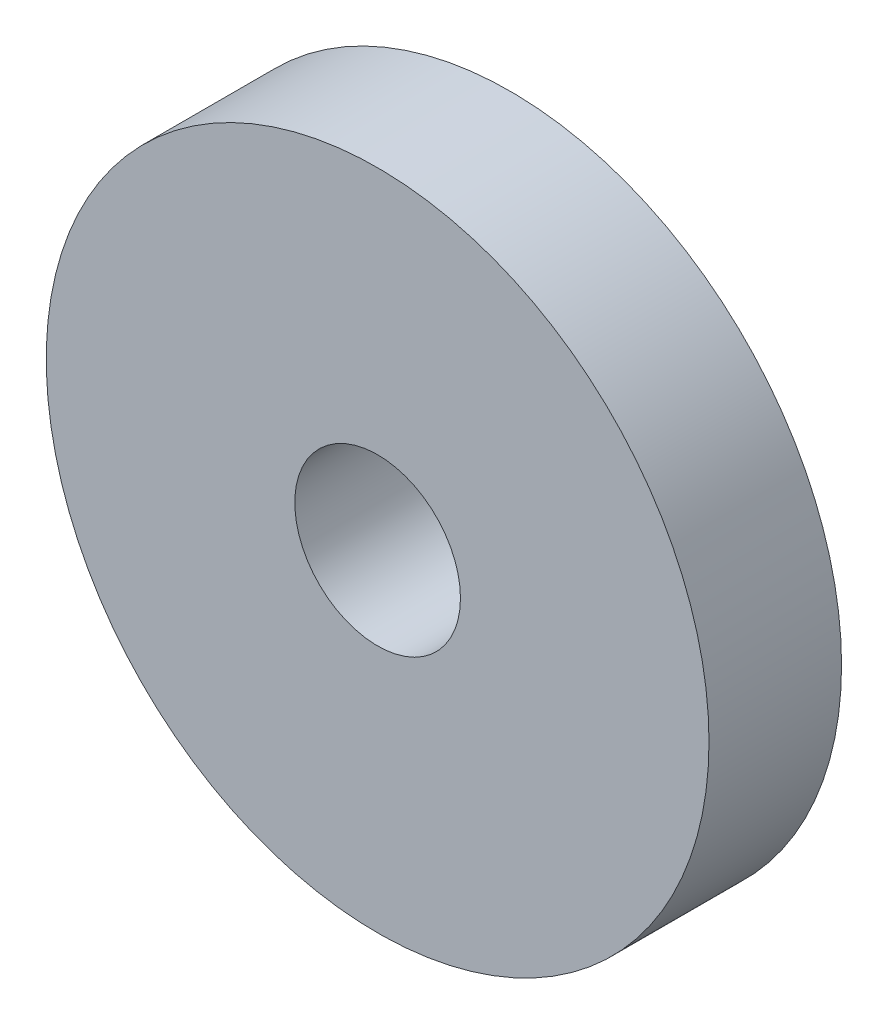
ISO-10303-21;
HEADER;
FILE_DESCRIPTION(('STEP AP214'),'2;1');
FILE_NAME('part.step','',(''),(''),'','','');
FILE_SCHEMA(('AUTOMOTIVE_DESIGN { 1 0 10303 214 1 1 1 1 }'));
ENDSEC;
DATA;
#1=APPLICATION_CONTEXT('core data for automotive mechanical design processes');
#2=APPLICATION_PROTOCOL_DEFINITION('international standard','automotive_design',2000,#1);
#3=PRODUCT_CONTEXT('',#1,'mechanical');
#4=PRODUCT('Part','Part','',(#3));
#5=PRODUCT_RELATED_PRODUCT_CATEGORY('part','',(#4));
#6=PRODUCT_DEFINITION_FORMATION('','',#4);
#7=PRODUCT_DEFINITION_CONTEXT('part definition',#1,'design');
#8=PRODUCT_DEFINITION('design','',#6,#7);
#9=PRODUCT_DEFINITION_SHAPE('','',#8);
#10=(LENGTH_UNIT() NAMED_UNIT(*) SI_UNIT(.MILLI.,.METRE.));
#11=(NAMED_UNIT(*) PLANE_ANGLE_UNIT() SI_UNIT($,.RADIAN.));
#12=(NAMED_UNIT(*) SI_UNIT($,.STERADIAN.) SOLID_ANGLE_UNIT());
#13=UNCERTAINTY_MEASURE_WITH_UNIT(LENGTH_MEASURE(1.E-05),#10,'distance_accuracy_value','');
#14=(GEOMETRIC_REPRESENTATION_CONTEXT(3) GLOBAL_UNCERTAINTY_ASSIGNED_CONTEXT((#13)) GLOBAL_UNIT_ASSIGNED_CONTEXT((#10,
#11,#12)) REPRESENTATION_CONTEXT('',''));
#15=CARTESIAN_POINT('',(0.,0.,0.));
#16=DIRECTION('',(0.,0.,1.));
#17=DIRECTION('',(1.,0.,0.));
#18=AXIS2_PLACEMENT_3D('',#15,#16,#17);
#19=CARTESIAN_POINT('',(0.,0.,2.));
#20=DIRECTION('',(0.,0.,1.));
#21=DIRECTION('',(1.,0.,0.));
#22=AXIS2_PLACEMENT_3D('',#19,#20,#21);
#23=PLANE('',#22);
#24=CARTESIAN_POINT('',(0.,0.,2.));
#25=DIRECTION('',(0.,0.,1.));
#26=DIRECTION('',(1.,0.,0.));
#27=AXIS2_PLACEMENT_3D('',#24,#25,#26);
#28=CIRCLE('',#27,4.99999999999989);
#29=CARTESIAN_POINT('',(4.99999999999989,0.,2.));
#30=VERTEX_POINT('',#29);
#31=EDGE_CURVE('E10',#30,#30,#28,.T.);
#32=ORIENTED_EDGE('',*,*,#31,.T.);
#33=EDGE_LOOP('',(#32));
#34=FACE_BOUND('',#33,.T.);
#35=CARTESIAN_POINT('',(0.,0.,2.));
#36=DIRECTION('',(0.,0.,1.));
#37=DIRECTION('',(1.,0.,0.));
#38=AXIS2_PLACEMENT_3D('',#35,#36,#37);
#39=CIRCLE('',#38,1.2500000000002);
#40=CARTESIAN_POINT('',(1.2500000000002,0.,2.));
#41=VERTEX_POINT('',#40);
#42=EDGE_CURVE('E41',#41,#41,#39,.T.);
#43=ORIENTED_EDGE('',*,*,#42,.F.);
#44=EDGE_LOOP('',(#43));
#45=FACE_BOUND('',#44,.T.);
#46=ADVANCED_FACE('F30',(#34,#45),#23,.T.);
#47=CARTESIAN_POINT('',(0.,0.,0.));
#48=DIRECTION('',(0.,0.,1.));
#49=DIRECTION('',(1.,0.,0.));
#50=AXIS2_PLACEMENT_3D('',#47,#48,#49);
#51=PLANE('',#50);
#52=CARTESIAN_POINT('',(0.,0.,0.));
#53=DIRECTION('',(0.,0.,1.));
#54=DIRECTION('',(1.,0.,0.));
#55=AXIS2_PLACEMENT_3D('',#52,#53,#54);
#56=CIRCLE('',#55,4.99999999999989);
#57=CARTESIAN_POINT('',(4.99999999999989,0.,0.));
#58=VERTEX_POINT('',#57);
#59=EDGE_CURVE('E34',#58,#58,#56,.T.);
#60=ORIENTED_EDGE('',*,*,#59,.F.);
#61=EDGE_LOOP('',(#60));
#62=FACE_BOUND('',#61,.T.);
#63=CARTESIAN_POINT('',(0.,0.,0.));
#64=DIRECTION('',(0.,0.,1.));
#65=DIRECTION('',(1.,0.,0.));
#66=AXIS2_PLACEMENT_3D('',#63,#64,#65);
#67=CIRCLE('',#66,1.2500000000002);
#68=CARTESIAN_POINT('',(1.2500000000002,0.,0.));
#69=VERTEX_POINT('',#68);
#70=EDGE_CURVE('E43',#69,#69,#67,.T.);
#71=ORIENTED_EDGE('',*,*,#70,.T.);
#72=EDGE_LOOP('',(#71));
#73=FACE_BOUND('',#72,.T.);
#74=ADVANCED_FACE('F53',(#62,#73),#51,.F.);
#75=CARTESIAN_POINT('',(0.,0.,2.));
#76=DIRECTION('',(0.,0.,-1.));
#77=DIRECTION('',(-1.,0.,0.));
#78=AXIS2_PLACEMENT_3D('',#75,#76,#77);
#79=CYLINDRICAL_SURFACE('',#78,4.99999999999989);
#80=ORIENTED_EDGE('',*,*,#31,.F.);
#81=EDGE_LOOP('',(#80));
#82=FACE_BOUND('',#81,.T.);
#83=ORIENTED_EDGE('',*,*,#59,.T.);
#84=EDGE_LOOP('',(#83));
#85=FACE_BOUND('',#84,.T.);
#86=ADVANCED_FACE('F32',(#82,#85),#79,.T.);
#87=CARTESIAN_POINT('',(0.,0.,2.));
#88=DIRECTION('',(0.,0.,-1.));
#89=DIRECTION('',(-1.,0.,0.));
#90=AXIS2_PLACEMENT_3D('',#87,#88,#89);
#91=CYLINDRICAL_SURFACE('',#90,1.2500000000002);
#92=ORIENTED_EDGE('',*,*,#42,.T.);
#93=EDGE_LOOP('',(#92));
#94=FACE_BOUND('',#93,.T.);
#95=ORIENTED_EDGE('',*,*,#70,.F.);
#96=EDGE_LOOP('',(#95));
#97=FACE_BOUND('',#96,.T.);
#98=ADVANCED_FACE('F49',(#94,#97),#91,.F.);
#99=CLOSED_SHELL('',(#46,#74,#86,#98));
#100=MANIFOLD_SOLID_BREP('B2',#99);
#101=ADVANCED_BREP_SHAPE_REPRESENTATION('',(#18,#100),#14);
#102=SHAPE_DEFINITION_REPRESENTATION(#9,#101);
ENDSEC;
END-ISO-10303-21;
